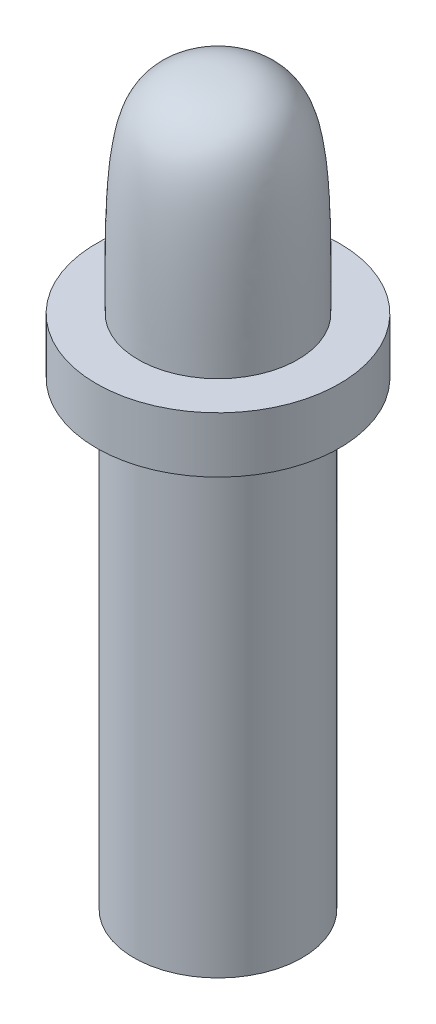
ISO-10303-21;
HEADER;
FILE_DESCRIPTION(('STEP AP214'),'2;1');
FILE_NAME('part.step','',(''),(''),'','','');
FILE_SCHEMA(('AUTOMOTIVE_DESIGN { 1 0 10303 214 1 1 1 1 }'));
ENDSEC;
DATA;
#1=APPLICATION_CONTEXT('core data for automotive mechanical design processes');
#2=APPLICATION_PROTOCOL_DEFINITION('international standard','automotive_design',2000,#1);
#3=PRODUCT_CONTEXT('',#1,'mechanical');
#4=PRODUCT('Part','Part','',(#3));
#5=PRODUCT_RELATED_PRODUCT_CATEGORY('part','',(#4));
#6=PRODUCT_DEFINITION_FORMATION('','',#4);
#7=PRODUCT_DEFINITION_CONTEXT('part definition',#1,'design');
#8=PRODUCT_DEFINITION('design','',#6,#7);
#9=PRODUCT_DEFINITION_SHAPE('','',#8);
#10=(LENGTH_UNIT() NAMED_UNIT(*) SI_UNIT(.MILLI.,.METRE.));
#11=(NAMED_UNIT(*) PLANE_ANGLE_UNIT() SI_UNIT($,.RADIAN.));
#12=(NAMED_UNIT(*) SI_UNIT($,.STERADIAN.) SOLID_ANGLE_UNIT());
#13=UNCERTAINTY_MEASURE_WITH_UNIT(LENGTH_MEASURE(1.E-05),#10,'distance_accuracy_value','');
#14=(GEOMETRIC_REPRESENTATION_CONTEXT(3) GLOBAL_UNCERTAINTY_ASSIGNED_CONTEXT((#13)) GLOBAL_UNIT_ASSIGNED_CONTEXT((#10,
#11,#12)) REPRESENTATION_CONTEXT('',''));
#15=CARTESIAN_POINT('',(0.,0.,0.));
#16=DIRECTION('',(0.,0.,1.));
#17=DIRECTION('',(1.,0.,0.));
#18=AXIS2_PLACEMENT_3D('',#15,#16,#17);
#19=CARTESIAN_POINT('',(0.,1.62902785632468,0.));
#20=DIRECTION('',(0.,-1.,0.));
#21=DIRECTION('',(0.,0.,-1.));
#22=AXIS2_PLACEMENT_3D('',#19,#20,#21);
#23=PLANE('',#22);
#24=CARTESIAN_POINT('',(0.,1.62902785632468,0.));
#25=DIRECTION('',(0.,-1.,0.));
#26=DIRECTION('',(0.,0.,-1.));
#27=AXIS2_PLACEMENT_3D('',#24,#25,#26);
#28=CIRCLE('',#27,2.33370308824036);
#29=CARTESIAN_POINT('',(0.,1.62902785632468,-2.33370308824036));
#30=VERTEX_POINT('',#29);
#31=EDGE_CURVE('E49',#30,#30,#28,.T.);
#32=ORIENTED_EDGE('',*,*,#31,.T.);
#33=EDGE_LOOP('',(#32));
#34=FACE_BOUND('',#33,.T.);
#35=CARTESIAN_POINT('',(0.,1.62902785632468,0.));
#36=DIRECTION('',(0.,-1.,0.));
#37=DIRECTION('',(0.,0.,-1.));
#38=AXIS2_PLACEMENT_3D('',#35,#36,#37);
#39=CIRCLE('',#38,3.555);
#40=CARTESIAN_POINT('',(0.,1.62902785632468,-3.555));
#41=VERTEX_POINT('',#40);
#42=EDGE_CURVE('E11',#41,#41,#39,.T.);
#43=ORIENTED_EDGE('',*,*,#42,.F.);
#44=EDGE_LOOP('',(#43));
#45=FACE_BOUND('',#44,.T.);
#46=ADVANCED_FACE('F33',(#34,#45),#23,.F.);
#47=CARTESIAN_POINT('',(0.,0.,0.));
#48=DIRECTION('',(0.,-1.,0.));
#49=DIRECTION('',(0.,0.,-1.));
#50=AXIS2_PLACEMENT_3D('',#47,#48,#49);
#51=CYLINDRICAL_SURFACE('',#50,3.555);
#52=ORIENTED_EDGE('',*,*,#42,.T.);
#53=EDGE_LOOP('',(#52));
#54=FACE_BOUND('',#53,.T.);
#55=CARTESIAN_POINT('',(0.,0.,0.));
#56=DIRECTION('',(0.,-1.,0.));
#57=DIRECTION('',(0.,0.,-1.));
#58=AXIS2_PLACEMENT_3D('',#55,#56,#57);
#59=CIRCLE('',#58,3.555);
#60=CARTESIAN_POINT('',(0.,0.,-3.555));
#61=VERTEX_POINT('',#60);
#62=EDGE_CURVE('E39',#61,#61,#59,.T.);
#63=ORIENTED_EDGE('',*,*,#62,.F.);
#64=EDGE_LOOP('',(#63));
#65=FACE_BOUND('',#64,.T.);
#66=ADVANCED_FACE('F68',(#54,#65),#51,.T.);
#67=CARTESIAN_POINT('',(0.,0.,0.));
#68=DIRECTION('',(0.,-1.,0.));
#69=DIRECTION('',(0.,0.,-1.));
#70=AXIS2_PLACEMENT_3D('',#67,#68,#69);
#71=PLANE('',#70);
#72=ORIENTED_EDGE('',*,*,#62,.T.);
#73=EDGE_LOOP('',(#72));
#74=FACE_BOUND('',#73,.T.);
#75=CARTESIAN_POINT('',(0.,0.,0.));
#76=DIRECTION('',(0.,-1.,0.));
#77=DIRECTION('',(0.,0.,-1.));
#78=AXIS2_PLACEMENT_3D('',#75,#76,#77);
#79=CIRCLE('',#78,2.45966655108987);
#80=CARTESIAN_POINT('',(0.,0.,-2.45966655108987));
#81=VERTEX_POINT('',#80);
#82=EDGE_CURVE('E54',#81,#81,#79,.T.);
#83=ORIENTED_EDGE('',*,*,#82,.F.);
#84=EDGE_LOOP('',(#83));
#85=FACE_BOUND('',#84,.T.);
#86=ADVANCED_FACE('F65',(#74,#85),#71,.T.);
#87=CARTESIAN_POINT('',(0.,0.,0.));
#88=DIRECTION('',(0.,-1.,0.));
#89=DIRECTION('',(0.,0.,-1.));
#90=AXIS2_PLACEMENT_3D('',#87,#88,#89);
#91=CYLINDRICAL_SURFACE('',#90,2.45966655108987);
#92=CARTESIAN_POINT('',(0.,-13.46,0.));
#93=DIRECTION('',(0.,-1.,0.));
#94=DIRECTION('',(0.,0.,-1.));
#95=AXIS2_PLACEMENT_3D('',#92,#93,#94);
#96=CIRCLE('',#95,2.45966655108987);
#97=CARTESIAN_POINT('',(0.,-13.46,-2.45966655108987));
#98=VERTEX_POINT('',#97);
#99=EDGE_CURVE('E51',#98,#98,#96,.T.);
#100=ORIENTED_EDGE('',*,*,#99,.F.);
#101=EDGE_LOOP('',(#100));
#102=FACE_BOUND('',#101,.T.);
#103=ORIENTED_EDGE('',*,*,#82,.T.);
#104=EDGE_LOOP('',(#103));
#105=FACE_BOUND('',#104,.T.);
#106=ADVANCED_FACE('F75',(#102,#105),#91,.T.);
#107=CARTESIAN_POINT('',(0.,-13.46,0.));
#108=DIRECTION('',(0.,-1.,0.));
#109=DIRECTION('',(0.,0.,-1.));
#110=AXIS2_PLACEMENT_3D('',#107,#108,#109);
#111=PLANE('',#110);
#112=ORIENTED_EDGE('',*,*,#99,.T.);
#113=EDGE_LOOP('',(#112));
#114=FACE_BOUND('',#113,.T.);
#115=ADVANCED_FACE('F45',(#114),#111,.T.);
#116=CARTESIAN_POINT('',(-2.33370308824036,1.62902785632468,0.));
#117=CARTESIAN_POINT('',(-2.33370308824036,2.66067575339835,0.));
#118=CARTESIAN_POINT('',(-2.4106690006898,6.4526713818754,0.));
#119=CARTESIAN_POINT('',(-1.42875941818007,7.52714324625408,0.));
#120=CARTESIAN_POINT('',(-0.659148129475593,7.77520317836089,0.));
#121=CARTESIAN_POINT('',(0.,7.77520317836089,0.));
#122=B_SPLINE_CURVE_WITH_KNOTS('',3,(#116,#117,#118,#119,#120,#121),.UNSPECIFIED.,.F.,.F.,(4,1,
1,4),(0.,0.421509283523588,0.743045006621045,1.),.UNSPECIFIED.);
#123=CARTESIAN_POINT('',(0.,0.,0.));
#124=DIRECTION('',(0.,-1.,0.));
#125=AXIS1_PLACEMENT('',#123,#124);
#126=SURFACE_OF_REVOLUTION('',#122,#125);
#127=CARTESIAN_POINT('',(0.,7.77520317836089,0.));
#128=VERTEX_POINT('',#127);
#129=VERTEX_LOOP('',#128);
#130=FACE_BOUND('',#129,.T.);
#131=ORIENTED_EDGE('',*,*,#31,.F.);
#132=EDGE_LOOP('',(#131));
#133=FACE_BOUND('',#132,.T.);
#134=ADVANCED_FACE('F42',(#130,#133),#126,.F.);
#135=CLOSED_SHELL('',(#46,#66,#86,#106,#115,#134));
#136=MANIFOLD_SOLID_BREP('B2',#135);
#137=ADVANCED_BREP_SHAPE_REPRESENTATION('',(#18,#136),#14);
#138=SHAPE_DEFINITION_REPRESENTATION(#9,#137);
ENDSEC;
END-ISO-10303-21;
